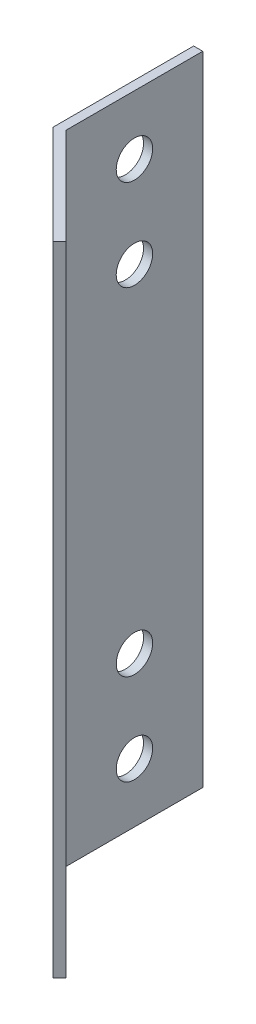
ISO-10303-21;
HEADER;
FILE_DESCRIPTION(('STEP AP214'),'2;1');
FILE_NAME('part.step','',(''),(''),'','','');
FILE_SCHEMA(('AUTOMOTIVE_DESIGN { 1 0 10303 214 1 1 1 1 }'));
ENDSEC;
DATA;
#1=APPLICATION_CONTEXT('core data for automotive mechanical design processes');
#2=APPLICATION_PROTOCOL_DEFINITION('international standard','automotive_design',2000,#1);
#3=PRODUCT_CONTEXT('',#1,'mechanical');
#4=PRODUCT('Part','Part','',(#3));
#5=PRODUCT_RELATED_PRODUCT_CATEGORY('part','',(#4));
#6=PRODUCT_DEFINITION_FORMATION('','',#4);
#7=PRODUCT_DEFINITION_CONTEXT('part definition',#1,'design');
#8=PRODUCT_DEFINITION('design','',#6,#7);
#9=PRODUCT_DEFINITION_SHAPE('','',#8);
#10=(LENGTH_UNIT() NAMED_UNIT(*) SI_UNIT(.MILLI.,.METRE.));
#11=(NAMED_UNIT(*) PLANE_ANGLE_UNIT() SI_UNIT($,.RADIAN.));
#12=(NAMED_UNIT(*) SI_UNIT($,.STERADIAN.) SOLID_ANGLE_UNIT());
#13=UNCERTAINTY_MEASURE_WITH_UNIT(LENGTH_MEASURE(1.E-05),#10,'distance_accuracy_value','');
#14=(GEOMETRIC_REPRESENTATION_CONTEXT(3) GLOBAL_UNCERTAINTY_ASSIGNED_CONTEXT((#13)) GLOBAL_UNIT_ASSIGNED_CONTEXT((#10,
#11,#12)) REPRESENTATION_CONTEXT('',''));
#15=CARTESIAN_POINT('',(0.,0.,0.));
#16=DIRECTION('',(0.,0.,1.));
#17=DIRECTION('',(1.,0.,0.));
#18=AXIS2_PLACEMENT_3D('',#15,#16,#17);
#19=CARTESIAN_POINT('',(10.8994949366117,70.,10.8994949366116));
#20=DIRECTION('',(0.707106781186546,0.,-0.707106781186549));
#21=DIRECTION('',(-0.707106781186549,0.,-0.707106781186546));
#22=AXIS2_PLACEMENT_3D('',#19,#20,#21);
#23=PLANE('',#22);
#24=CARTESIAN_POINT('',(5.59619407771257,16.5,5.59619407771255));
#25=DIRECTION('',(0.707106781186546,0.,-0.707106781186549));
#26=DIRECTION('',(-0.707106781186549,0.,-0.707106781186546));
#27=AXIS2_PLACEMENT_3D('',#24,#25,#26);
#28=CIRCLE('',#27,2.);
#29=CARTESIAN_POINT('',(4.18198051533948,16.5,4.18198051533946));
#30=VERTEX_POINT('',#29);
#31=EDGE_CURVE('E161',#30,#30,#28,.F.);
#32=ORIENTED_EDGE('',*,*,#31,.F.);
#33=EDGE_LOOP('',(#32));
#34=FACE_BOUND('',#33,.T.);
#35=CARTESIAN_POINT('',(5.59619407771257,6.50000000000001,5.59619407771255));
#36=DIRECTION('',(0.707106781186546,0.,-0.707106781186549));
#37=DIRECTION('',(-0.707106781186549,0.,-0.707106781186546));
#38=AXIS2_PLACEMENT_3D('',#35,#36,#37);
#39=CIRCLE('',#38,2.);
#40=CARTESIAN_POINT('',(4.18198051533948,6.50000000000001,4.18198051533946));
#41=VERTEX_POINT('',#40);
#42=EDGE_CURVE('E165',#41,#41,#39,.F.);
#43=ORIENTED_EDGE('',*,*,#42,.F.);
#44=EDGE_LOOP('',(#43));
#45=FACE_BOUND('',#44,.T.);
#46=CARTESIAN_POINT('',(5.59619407771257,63.5,5.59619407771255));
#47=DIRECTION('',(0.707106781186546,0.,-0.707106781186549));
#48=DIRECTION('',(-0.707106781186549,0.,-0.707106781186546));
#49=AXIS2_PLACEMENT_3D('',#46,#47,#48);
#50=CIRCLE('',#49,2.);
#51=CARTESIAN_POINT('',(4.18198051533947,63.5,4.18198051533946));
#52=VERTEX_POINT('',#51);
#53=EDGE_CURVE('E169',#52,#52,#50,.F.);
#54=ORIENTED_EDGE('',*,*,#53,.F.);
#55=EDGE_LOOP('',(#54));
#56=FACE_BOUND('',#55,.T.);
#57=CARTESIAN_POINT('',(5.59619407771257,53.5,5.59619407771255));
#58=DIRECTION('',(0.707106781186546,0.,-0.707106781186549));
#59=DIRECTION('',(-0.707106781186549,0.,-0.707106781186546));
#60=AXIS2_PLACEMENT_3D('',#57,#58,#59);
#61=CIRCLE('',#60,2.);
#62=CARTESIAN_POINT('',(4.18198051533947,53.5,4.18198051533945));
#63=VERTEX_POINT('',#62);
#64=EDGE_CURVE('E172',#63,#63,#61,.F.);
#65=ORIENTED_EDGE('',*,*,#64,.F.);
#66=EDGE_LOOP('',(#65));
#67=FACE_BOUND('',#66,.T.);
#68=DIRECTION('',(0.707106781186549,0.,0.707106781186546));
#69=VECTOR('',#68,1.);
#70=CARTESIAN_POINT('',(10.8994949366117,0.,10.8994949366116));
#71=LINE('',#70,#69);
#72=CARTESIAN_POINT('',(0.,0.,0.));
#73=VERTEX_POINT('',#72);
#74=CARTESIAN_POINT('',(10.8994949366117,0.,10.8994949366116));
#75=VERTEX_POINT('',#74);
#76=EDGE_CURVE('E115',#73,#75,#71,.T.);
#77=ORIENTED_EDGE('',*,*,#76,.T.);
#78=DIRECTION('',(0.,-1.,0.));
#79=VECTOR('',#78,1.);
#80=CARTESIAN_POINT('',(10.8994949366117,70.,10.8994949366116));
#81=LINE('',#80,#79);
#82=CARTESIAN_POINT('',(10.8994949366117,70.,10.8994949366116));
#83=VERTEX_POINT('',#82);
#84=EDGE_CURVE('E11',#83,#75,#81,.T.);
#85=ORIENTED_EDGE('',*,*,#84,.F.);
#86=DIRECTION('',(0.707106781186549,0.,0.707106781186546));
#87=VECTOR('',#86,1.);
#88=CARTESIAN_POINT('',(10.8994949366117,70.,10.8994949366116));
#89=LINE('',#88,#87);
#90=CARTESIAN_POINT('',(0.,70.,0.));
#91=VERTEX_POINT('',#90);
#92=EDGE_CURVE('E126',#91,#83,#89,.T.);
#93=ORIENTED_EDGE('',*,*,#92,.F.);
#94=DIRECTION('',(0.,-1.,0.));
#95=VECTOR('',#94,1.);
#96=CARTESIAN_POINT('',(0.,70.,0.));
#97=LINE('',#96,#95);
#98=EDGE_CURVE('E111',#91,#73,#97,.T.);
#99=ORIENTED_EDGE('',*,*,#98,.T.);
#100=EDGE_LOOP('',(#77,#85,#93,#99));
#101=FACE_BOUND('',#100,.T.);
#102=ADVANCED_FACE('F31',(#34,#45,#56,#67,#101),#23,.F.);
#103=CARTESIAN_POINT('',(11.6066017177982,70.,10.1923881554251));
#104=DIRECTION('',(-0.707106781186552,0.,-0.707106781186543));
#105=DIRECTION('',(-0.707106781186543,0.,0.707106781186552));
#106=AXIS2_PLACEMENT_3D('',#103,#104,#105);
#107=PLANE('',#106);
#108=DIRECTION('',(0.707106781186543,0.,-0.707106781186552));
#109=VECTOR('',#108,1.);
#110=CARTESIAN_POINT('',(11.6066017177982,0.,10.1923881554251));
#111=LINE('',#110,#109);
#112=CARTESIAN_POINT('',(11.6066017177982,0.,10.1923881554251));
#113=VERTEX_POINT('',#112);
#114=EDGE_CURVE('E118',#75,#113,#111,.T.);
#115=ORIENTED_EDGE('',*,*,#114,.T.);
#116=DIRECTION('',(0.,-1.,0.));
#117=VECTOR('',#116,1.);
#118=CARTESIAN_POINT('',(11.6066017177982,70.,10.1923881554251));
#119=LINE('',#118,#117);
#120=CARTESIAN_POINT('',(11.6066017177982,70.,10.1923881554251));
#121=VERTEX_POINT('',#120);
#122=EDGE_CURVE('E39',#121,#113,#119,.T.);
#123=ORIENTED_EDGE('',*,*,#122,.F.);
#124=DIRECTION('',(0.707106781186543,0.,-0.707106781186552));
#125=VECTOR('',#124,1.);
#126=CARTESIAN_POINT('',(11.6066017177982,70.,10.1923881554251));
#127=LINE('',#126,#125);
#128=EDGE_CURVE('E84',#83,#121,#127,.T.);
#129=ORIENTED_EDGE('',*,*,#128,.F.);
#130=ORIENTED_EDGE('',*,*,#84,.T.);
#131=EDGE_LOOP('',(#115,#123,#129,#130));
#132=FACE_BOUND('',#131,.T.);
#133=ADVANCED_FACE('F153',(#132),#107,.F.);
#134=CARTESIAN_POINT('',(1.,70.,-0.414213562373096));
#135=DIRECTION('',(-0.707106781186546,0.,0.707106781186549));
#136=DIRECTION('',(0.707106781186549,0.,0.707106781186546));
#137=AXIS2_PLACEMENT_3D('',#134,#135,#136);
#138=PLANE('',#137);
#139=CARTESIAN_POINT('',(6.30330085889912,16.5,4.889087296526));
#140=DIRECTION('',(0.707106781186546,0.,-0.707106781186549));
#141=DIRECTION('',(0.707106781186549,0.,0.707106781186546));
#142=AXIS2_PLACEMENT_3D('',#139,#140,#141);
#143=CIRCLE('',#142,2.);
#144=CARTESIAN_POINT('',(7.71751442127222,16.5,6.30330085889909));
#145=VERTEX_POINT('',#144);
#146=EDGE_CURVE('E247',#145,#145,#143,.T.);
#147=ORIENTED_EDGE('',*,*,#146,.F.);
#148=EDGE_LOOP('',(#147));
#149=FACE_BOUND('',#148,.T.);
#150=CARTESIAN_POINT('',(6.30330085889912,6.50000000000001,4.889087296526));
#151=DIRECTION('',(0.707106781186546,0.,-0.707106781186549));
#152=DIRECTION('',(0.707106781186549,0.,0.707106781186546));
#153=AXIS2_PLACEMENT_3D('',#150,#151,#152);
#154=CIRCLE('',#153,2.);
#155=CARTESIAN_POINT('',(7.71751442127222,6.50000000000001,6.30330085889909));
#156=VERTEX_POINT('',#155);
#157=EDGE_CURVE('E248',#156,#156,#154,.T.);
#158=ORIENTED_EDGE('',*,*,#157,.F.);
#159=EDGE_LOOP('',(#158));
#160=FACE_BOUND('',#159,.T.);
#161=CARTESIAN_POINT('',(6.30330085889912,63.5,4.889087296526));
#162=DIRECTION('',(0.707106781186546,0.,-0.707106781186549));
#163=DIRECTION('',(-0.707106781186549,0.,-0.707106781186546));
#164=AXIS2_PLACEMENT_3D('',#161,#162,#163);
#165=CIRCLE('',#164,2.);
#166=CARTESIAN_POINT('',(4.88908729652602,63.5,3.47487373415291));
#167=VERTEX_POINT('',#166);
#168=EDGE_CURVE('E255',#167,#167,#165,.T.);
#169=ORIENTED_EDGE('',*,*,#168,.F.);
#170=EDGE_LOOP('',(#169));
#171=FACE_BOUND('',#170,.T.);
#172=CARTESIAN_POINT('',(6.30330085889912,53.5,4.889087296526));
#173=DIRECTION('',(0.707106781186546,0.,-0.707106781186549));
#174=DIRECTION('',(-0.707106781186549,0.,-0.707106781186546));
#175=AXIS2_PLACEMENT_3D('',#172,#173,#174);
#176=CIRCLE('',#175,2.);
#177=CARTESIAN_POINT('',(4.88908729652602,53.5,3.4748737341529));
#178=VERTEX_POINT('',#177);
#179=EDGE_CURVE('E175',#178,#178,#176,.T.);
#180=ORIENTED_EDGE('',*,*,#179,.F.);
#181=EDGE_LOOP('',(#180));
#182=FACE_BOUND('',#181,.T.);
#183=DIRECTION('',(-0.707106781186549,0.,-0.707106781186546));
#184=VECTOR('',#183,1.);
#185=CARTESIAN_POINT('',(1.,0.,-0.414213562373096));
#186=LINE('',#185,#184);
#187=CARTESIAN_POINT('',(1.,0.,-0.414213562373096));
#188=VERTEX_POINT('',#187);
#189=EDGE_CURVE('E121',#113,#188,#186,.T.);
#190=ORIENTED_EDGE('',*,*,#189,.T.);
#191=DIRECTION('',(0.,-1.,0.));
#192=VECTOR('',#191,1.);
#193=CARTESIAN_POINT('',(1.,70.,-0.414213562373096));
#194=LINE('',#193,#192);
#195=CARTESIAN_POINT('',(1.,70.,-0.414213562373096));
#196=VERTEX_POINT('',#195);
#197=EDGE_CURVE('E106',#196,#188,#194,.T.);
#198=ORIENTED_EDGE('',*,*,#197,.F.);
#199=DIRECTION('',(-0.707106781186549,0.,-0.707106781186546));
#200=VECTOR('',#199,1.);
#201=CARTESIAN_POINT('',(1.,70.,-0.414213562373096));
#202=LINE('',#201,#200);
#203=EDGE_CURVE('E97',#121,#196,#202,.T.);
#204=ORIENTED_EDGE('',*,*,#203,.F.);
#205=ORIENTED_EDGE('',*,*,#122,.T.);
#206=EDGE_LOOP('',(#190,#198,#204,#205));
#207=FACE_BOUND('',#206,.T.);
#208=ADVANCED_FACE('F132',(#149,#160,#171,#182,#207),#138,.F.);
#209=CARTESIAN_POINT('',(1.,70.,-15.4142135623731));
#210=DIRECTION('',(-1.,0.,0.));
#211=DIRECTION('',(0.,0.,1.));
#212=AXIS2_PLACEMENT_3D('',#209,#210,#211);
#213=PLANE('',#212);
#214=CARTESIAN_POINT('',(1.,63.5,-7.9142135623731));
#215=DIRECTION('',(1.,0.,0.));
#216=DIRECTION('',(0.,0.,1.));
#217=AXIS2_PLACEMENT_3D('',#214,#215,#216);
#218=CIRCLE('',#217,2.);
#219=CARTESIAN_POINT('',(1.,63.5,-5.9142135623731));
#220=VERTEX_POINT('',#219);
#221=EDGE_CURVE('E174',#220,#220,#218,.T.);
#222=ORIENTED_EDGE('',*,*,#221,.F.);
#223=EDGE_LOOP('',(#222));
#224=FACE_BOUND('',#223,.T.);
#225=CARTESIAN_POINT('',(1.,53.5,-7.9142135623731));
#226=DIRECTION('',(1.,0.,0.));
#227=DIRECTION('',(0.,0.,1.));
#228=AXIS2_PLACEMENT_3D('',#225,#226,#227);
#229=CIRCLE('',#228,2.);
#230=CARTESIAN_POINT('',(1.,53.5,-5.9142135623731));
#231=VERTEX_POINT('',#230);
#232=EDGE_CURVE('E186',#231,#231,#229,.T.);
#233=ORIENTED_EDGE('',*,*,#232,.F.);
#234=EDGE_LOOP('',(#233));
#235=FACE_BOUND('',#234,.T.);
#236=CARTESIAN_POINT('',(1.,6.5,-7.9142135623731));
#237=DIRECTION('',(1.,0.,0.));
#238=DIRECTION('',(0.,0.,-1.));
#239=AXIS2_PLACEMENT_3D('',#236,#237,#238);
#240=CIRCLE('',#239,2.);
#241=CARTESIAN_POINT('',(1.,6.5,-9.9142135623731));
#242=VERTEX_POINT('',#241);
#243=EDGE_CURVE('E192',#242,#242,#240,.T.);
#244=ORIENTED_EDGE('',*,*,#243,.F.);
#245=EDGE_LOOP('',(#244));
#246=FACE_BOUND('',#245,.T.);
#247=CARTESIAN_POINT('',(1.,16.5,-7.9142135623731));
#248=DIRECTION('',(1.,0.,0.));
#249=DIRECTION('',(0.,0.,-1.));
#250=AXIS2_PLACEMENT_3D('',#247,#248,#249);
#251=CIRCLE('',#250,2.);
#252=CARTESIAN_POINT('',(1.,16.5,-9.9142135623731));
#253=VERTEX_POINT('',#252);
#254=EDGE_CURVE('E198',#253,#253,#251,.T.);
#255=ORIENTED_EDGE('',*,*,#254,.F.);
#256=EDGE_LOOP('',(#255));
#257=FACE_BOUND('',#256,.T.);
#258=DIRECTION('',(0.,0.,-1.));
#259=VECTOR('',#258,1.);
#260=CARTESIAN_POINT('',(1.,0.,-15.4142135623731));
#261=LINE('',#260,#259);
#262=CARTESIAN_POINT('',(1.,0.,-15.4142135623731));
#263=VERTEX_POINT('',#262);
#264=EDGE_CURVE('E105',#188,#263,#261,.T.);
#265=ORIENTED_EDGE('',*,*,#264,.T.);
#266=DIRECTION('',(0.,-1.,0.));
#267=VECTOR('',#266,1.);
#268=CARTESIAN_POINT('',(1.,70.,-15.4142135623731));
#269=LINE('',#268,#267);
#270=CARTESIAN_POINT('',(1.,70.,-15.4142135623731));
#271=VERTEX_POINT('',#270);
#272=EDGE_CURVE('E102',#271,#263,#269,.T.);
#273=ORIENTED_EDGE('',*,*,#272,.F.);
#274=DIRECTION('',(0.,0.,-1.));
#275=VECTOR('',#274,1.);
#276=CARTESIAN_POINT('',(1.,70.,-15.4142135623731));
#277=LINE('',#276,#275);
#278=EDGE_CURVE('E91',#196,#271,#277,.T.);
#279=ORIENTED_EDGE('',*,*,#278,.F.);
#280=ORIENTED_EDGE('',*,*,#197,.T.);
#281=EDGE_LOOP('',(#265,#273,#279,#280));
#282=FACE_BOUND('',#281,.T.);
#283=ADVANCED_FACE('F103',(#224,#235,#246,#257,#282),#213,.F.);
#284=CARTESIAN_POINT('',(0.,70.,-15.4142135623731));
#285=DIRECTION('',(0.,0.,1.));
#286=DIRECTION('',(1.,0.,0.));
#287=AXIS2_PLACEMENT_3D('',#284,#285,#286);
#288=PLANE('',#287);
#289=DIRECTION('',(-1.,0.,0.));
#290=VECTOR('',#289,1.);
#291=CARTESIAN_POINT('',(0.,0.,-15.4142135623731));
#292=LINE('',#291,#290);
#293=CARTESIAN_POINT('',(0.,0.,-15.4142135623731));
#294=VERTEX_POINT('',#293);
#295=EDGE_CURVE('E70',#263,#294,#292,.T.);
#296=ORIENTED_EDGE('',*,*,#295,.T.);
#297=DIRECTION('',(0.,-1.,0.));
#298=VECTOR('',#297,1.);
#299=CARTESIAN_POINT('',(0.,70.,-15.4142135623731));
#300=LINE('',#299,#298);
#301=CARTESIAN_POINT('',(0.,70.,-15.4142135623731));
#302=VERTEX_POINT('',#301);
#303=EDGE_CURVE('E107',#302,#294,#300,.T.);
#304=ORIENTED_EDGE('',*,*,#303,.F.);
#305=DIRECTION('',(-1.,0.,0.));
#306=VECTOR('',#305,1.);
#307=CARTESIAN_POINT('',(0.,70.,-15.4142135623731));
#308=LINE('',#307,#306);
#309=EDGE_CURVE('E95',#271,#302,#308,.T.);
#310=ORIENTED_EDGE('',*,*,#309,.F.);
#311=ORIENTED_EDGE('',*,*,#272,.T.);
#312=EDGE_LOOP('',(#296,#304,#310,#311));
#313=FACE_BOUND('',#312,.T.);
#314=ADVANCED_FACE('F109',(#313),#288,.F.);
#315=CARTESIAN_POINT('',(0.,70.,0.));
#316=DIRECTION('',(1.,0.,0.));
#317=DIRECTION('',(0.,0.,-1.));
#318=AXIS2_PLACEMENT_3D('',#315,#316,#317);
#319=PLANE('',#318);
#320=CARTESIAN_POINT('',(0.,63.5,-7.9142135623731));
#321=DIRECTION('',(1.,0.,0.));
#322=DIRECTION('',(0.,0.,-1.));
#323=AXIS2_PLACEMENT_3D('',#320,#321,#322);
#324=CIRCLE('',#323,2.);
#325=CARTESIAN_POINT('',(0.,63.5,-9.9142135623731));
#326=VERTEX_POINT('',#325);
#327=EDGE_CURVE('E178',#326,#326,#324,.F.);
#328=ORIENTED_EDGE('',*,*,#327,.F.);
#329=EDGE_LOOP('',(#328));
#330=FACE_BOUND('',#329,.T.);
#331=CARTESIAN_POINT('',(0.,53.5,-7.9142135623731));
#332=DIRECTION('',(1.,0.,0.));
#333=DIRECTION('',(0.,0.,-1.));
#334=AXIS2_PLACEMENT_3D('',#331,#332,#333);
#335=CIRCLE('',#334,2.);
#336=CARTESIAN_POINT('',(0.,53.5,-9.9142135623731));
#337=VERTEX_POINT('',#336);
#338=EDGE_CURVE('E189',#337,#337,#335,.F.);
#339=ORIENTED_EDGE('',*,*,#338,.F.);
#340=EDGE_LOOP('',(#339));
#341=FACE_BOUND('',#340,.T.);
#342=CARTESIAN_POINT('',(0.,6.5,-7.9142135623731));
#343=DIRECTION('',(1.,0.,0.));
#344=DIRECTION('',(0.,0.,-1.));
#345=AXIS2_PLACEMENT_3D('',#342,#343,#344);
#346=CIRCLE('',#345,2.);
#347=CARTESIAN_POINT('',(0.,6.5,-9.9142135623731));
#348=VERTEX_POINT('',#347);
#349=EDGE_CURVE('E195',#348,#348,#346,.F.);
#350=ORIENTED_EDGE('',*,*,#349,.F.);
#351=EDGE_LOOP('',(#350));
#352=FACE_BOUND('',#351,.T.);
#353=CARTESIAN_POINT('',(0.,16.5,-7.9142135623731));
#354=DIRECTION('',(1.,0.,0.));
#355=DIRECTION('',(0.,0.,-1.));
#356=AXIS2_PLACEMENT_3D('',#353,#354,#355);
#357=CIRCLE('',#356,2.);
#358=CARTESIAN_POINT('',(0.,16.5,-9.9142135623731));
#359=VERTEX_POINT('',#358);
#360=EDGE_CURVE('E119',#359,#359,#357,.F.);
#361=ORIENTED_EDGE('',*,*,#360,.F.);
#362=EDGE_LOOP('',(#361));
#363=FACE_BOUND('',#362,.T.);
#364=DIRECTION('',(0.,0.,1.));
#365=VECTOR('',#364,1.);
#366=CARTESIAN_POINT('',(0.,0.,0.));
#367=LINE('',#366,#365);
#368=EDGE_CURVE('E76',#294,#73,#367,.T.);
#369=ORIENTED_EDGE('',*,*,#368,.T.);
#370=ORIENTED_EDGE('',*,*,#98,.F.);
#371=DIRECTION('',(0.,0.,1.));
#372=VECTOR('',#371,1.);
#373=CARTESIAN_POINT('',(0.,70.,0.));
#374=LINE('',#373,#372);
#375=EDGE_CURVE('E47',#302,#91,#374,.T.);
#376=ORIENTED_EDGE('',*,*,#375,.F.);
#377=ORIENTED_EDGE('',*,*,#303,.T.);
#378=EDGE_LOOP('',(#369,#370,#376,#377));
#379=FACE_BOUND('',#378,.T.);
#380=ADVANCED_FACE('F139',(#330,#341,#352,#363,#379),#319,.F.);
#381=CARTESIAN_POINT('',(10.8994949366117,70.,10.8994949366116));
#382=DIRECTION('',(0.,1.,0.));
#383=DIRECTION('',(0.,0.,1.));
#384=AXIS2_PLACEMENT_3D('',#381,#382,#383);
#385=PLANE('',#384);
#386=ORIENTED_EDGE('',*,*,#92,.T.);
#387=ORIENTED_EDGE('',*,*,#128,.T.);
#388=ORIENTED_EDGE('',*,*,#203,.T.);
#389=ORIENTED_EDGE('',*,*,#278,.T.);
#390=ORIENTED_EDGE('',*,*,#309,.T.);
#391=ORIENTED_EDGE('',*,*,#375,.T.);
#392=EDGE_LOOP('',(#386,#387,#388,#389,#390,#391));
#393=FACE_BOUND('',#392,.T.);
#394=ADVANCED_FACE('F93',(#393),#385,.T.);
#395=CARTESIAN_POINT('',(10.8994949366117,0.,10.8994949366116));
#396=DIRECTION('',(0.,1.,0.));
#397=DIRECTION('',(0.,0.,1.));
#398=AXIS2_PLACEMENT_3D('',#395,#396,#397);
#399=PLANE('',#398);
#400=ORIENTED_EDGE('',*,*,#76,.F.);
#401=ORIENTED_EDGE('',*,*,#368,.F.);
#402=ORIENTED_EDGE('',*,*,#295,.F.);
#403=ORIENTED_EDGE('',*,*,#264,.F.);
#404=ORIENTED_EDGE('',*,*,#189,.F.);
#405=ORIENTED_EDGE('',*,*,#114,.F.);
#406=EDGE_LOOP('',(#400,#401,#402,#403,#404,#405));
#407=FACE_BOUND('',#406,.T.);
#408=ADVANCED_FACE('F135',(#407),#399,.F.);
#409=CARTESIAN_POINT('',(-0.00100000000000208,16.5,-7.9142135623731));
#410=DIRECTION('',(1.,0.,0.));
#411=DIRECTION('',(0.,0.,-1.));
#412=AXIS2_PLACEMENT_3D('',#409,#410,#411);
#413=CYLINDRICAL_SURFACE('',#412,2.);
#414=ORIENTED_EDGE('',*,*,#254,.T.);
#415=EDGE_LOOP('',(#414));
#416=FACE_BOUND('',#415,.T.);
#417=ORIENTED_EDGE('',*,*,#360,.T.);
#418=EDGE_LOOP('',(#417));
#419=FACE_BOUND('',#418,.T.);
#420=ADVANCED_FACE('F206',(#416,#419),#413,.F.);
#421=CARTESIAN_POINT('',(-0.00100000000000208,6.5,-7.9142135623731));
#422=DIRECTION('',(1.,0.,0.));
#423=DIRECTION('',(0.,0.,-1.));
#424=AXIS2_PLACEMENT_3D('',#421,#422,#423);
#425=CYLINDRICAL_SURFACE('',#424,2.);
#426=ORIENTED_EDGE('',*,*,#243,.T.);
#427=EDGE_LOOP('',(#426));
#428=FACE_BOUND('',#427,.T.);
#429=ORIENTED_EDGE('',*,*,#349,.T.);
#430=EDGE_LOOP('',(#429));
#431=FACE_BOUND('',#430,.T.);
#432=ADVANCED_FACE('F209',(#428,#431),#425,.F.);
#433=CARTESIAN_POINT('',(-0.00100000000000208,53.5,-7.9142135623731));
#434=DIRECTION('',(1.,0.,0.));
#435=DIRECTION('',(0.,0.,-1.));
#436=AXIS2_PLACEMENT_3D('',#433,#434,#435);
#437=CYLINDRICAL_SURFACE('',#436,2.);
#438=ORIENTED_EDGE('',*,*,#232,.T.);
#439=EDGE_LOOP('',(#438));
#440=FACE_BOUND('',#439,.T.);
#441=ORIENTED_EDGE('',*,*,#338,.T.);
#442=EDGE_LOOP('',(#441));
#443=FACE_BOUND('',#442,.T.);
#444=ADVANCED_FACE('F216',(#440,#443),#437,.F.);
#445=CARTESIAN_POINT('',(-0.00100000000000208,63.5,-7.9142135623731));
#446=DIRECTION('',(1.,0.,0.));
#447=DIRECTION('',(0.,0.,-1.));
#448=AXIS2_PLACEMENT_3D('',#445,#446,#447);
#449=CYLINDRICAL_SURFACE('',#448,2.);
#450=ORIENTED_EDGE('',*,*,#221,.T.);
#451=EDGE_LOOP('',(#450));
#452=FACE_BOUND('',#451,.T.);
#453=ORIENTED_EDGE('',*,*,#327,.T.);
#454=EDGE_LOOP('',(#453));
#455=FACE_BOUND('',#454,.T.);
#456=ADVANCED_FACE('F222',(#452,#455),#449,.F.);
#457=CARTESIAN_POINT('',(0.145446609406748,53.5,11.0469415460184));
#458=DIRECTION('',(0.707106781186546,0.,-0.707106781186549));
#459=DIRECTION('',(-0.707106781186549,0.,-0.707106781186546));
#460=AXIS2_PLACEMENT_3D('',#457,#458,#459);
#461=CYLINDRICAL_SURFACE('',#460,2.);
#462=ORIENTED_EDGE('',*,*,#179,.T.);
#463=EDGE_LOOP('',(#462));
#464=FACE_BOUND('',#463,.T.);
#465=ORIENTED_EDGE('',*,*,#64,.T.);
#466=EDGE_LOOP('',(#465));
#467=FACE_BOUND('',#466,.T.);
#468=ADVANCED_FACE('F226',(#464,#467),#461,.F.);
#469=CARTESIAN_POINT('',(0.14544660940675,63.5,11.0469415460184));
#470=DIRECTION('',(0.707106781186546,0.,-0.707106781186549));
#471=DIRECTION('',(-0.707106781186549,0.,-0.707106781186546));
#472=AXIS2_PLACEMENT_3D('',#469,#470,#471);
#473=CYLINDRICAL_SURFACE('',#472,2.);
#474=ORIENTED_EDGE('',*,*,#168,.T.);
#475=EDGE_LOOP('',(#474));
#476=FACE_BOUND('',#475,.T.);
#477=ORIENTED_EDGE('',*,*,#53,.T.);
#478=EDGE_LOOP('',(#477));
#479=FACE_BOUND('',#478,.T.);
#480=ADVANCED_FACE('F230',(#476,#479),#473,.F.);
#481=CARTESIAN_POINT('',(0.145446609406753,6.50000000000001,11.0469415460184));
#482=DIRECTION('',(0.707106781186546,0.,-0.707106781186549));
#483=DIRECTION('',(-0.707106781186549,0.,-0.707106781186546));
#484=AXIS2_PLACEMENT_3D('',#481,#482,#483);
#485=CYLINDRICAL_SURFACE('',#484,2.);
#486=ORIENTED_EDGE('',*,*,#157,.T.);
#487=EDGE_LOOP('',(#486));
#488=FACE_BOUND('',#487,.T.);
#489=ORIENTED_EDGE('',*,*,#42,.T.);
#490=EDGE_LOOP('',(#489));
#491=FACE_BOUND('',#490,.T.);
#492=ADVANCED_FACE('F234',(#488,#491),#485,.F.);
#493=CARTESIAN_POINT('',(0.14544660940675,16.5,11.0469415460184));
#494=DIRECTION('',(0.707106781186546,0.,-0.707106781186549));
#495=DIRECTION('',(-0.707106781186549,0.,-0.707106781186546));
#496=AXIS2_PLACEMENT_3D('',#493,#494,#495);
#497=CYLINDRICAL_SURFACE('',#496,2.);
#498=ORIENTED_EDGE('',*,*,#146,.T.);
#499=EDGE_LOOP('',(#498));
#500=FACE_BOUND('',#499,.T.);
#501=ORIENTED_EDGE('',*,*,#31,.T.);
#502=EDGE_LOOP('',(#501));
#503=FACE_BOUND('',#502,.T.);
#504=ADVANCED_FACE('F238',(#500,#503),#497,.F.);
#505=CLOSED_SHELL('',(#102,#133,#208,#283,#314,#380,#394,#408,#420,#432,#444,#456,#468,#480,
#492,#504));
#506=MANIFOLD_SOLID_BREP('B2',#505);
#507=ADVANCED_BREP_SHAPE_REPRESENTATION('',(#18,#506),#14);
#508=SHAPE_DEFINITION_REPRESENTATION(#9,#507);
ENDSEC;
END-ISO-10303-21;
